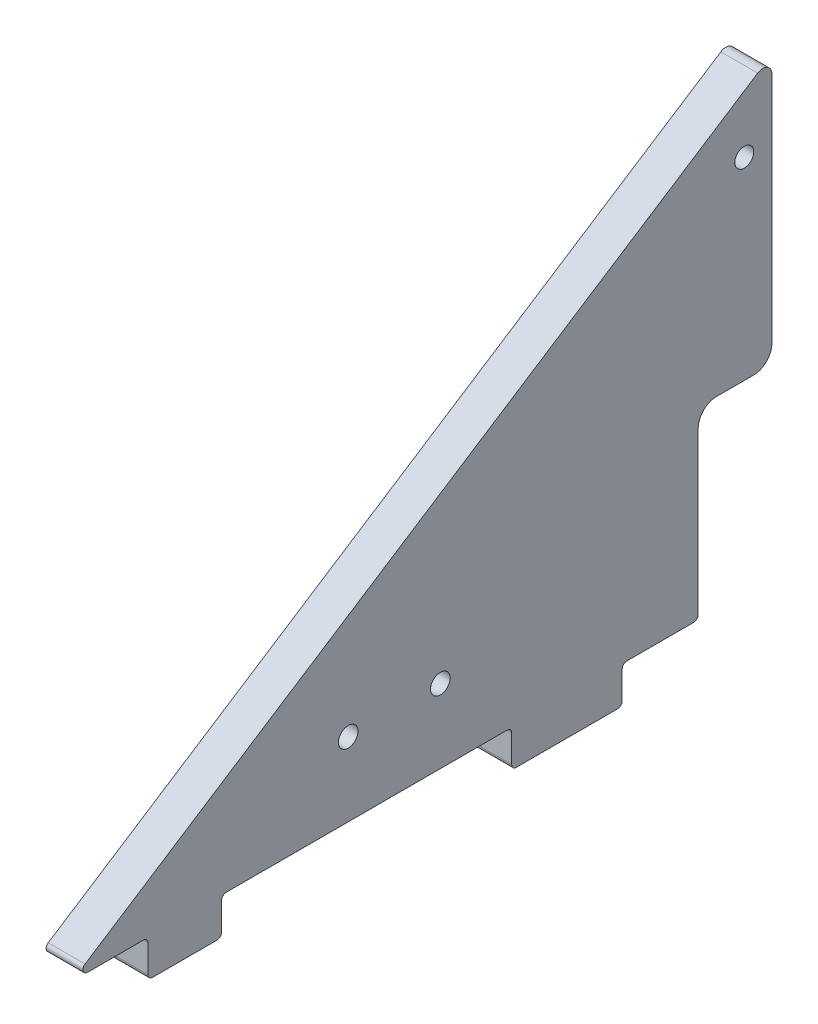
ISO-10303-21;
HEADER;
FILE_DESCRIPTION(('STEP AP214'),'2;1');
FILE_NAME('part.step','',(''),(''),'','','');
FILE_SCHEMA(('AUTOMOTIVE_DESIGN { 1 0 10303 214 1 1 1 1 }'));
ENDSEC;
DATA;
#1=APPLICATION_CONTEXT('core data for automotive mechanical design processes');
#2=APPLICATION_PROTOCOL_DEFINITION('international standard','automotive_design',2000,#1);
#3=PRODUCT_CONTEXT('',#1,'mechanical');
#4=PRODUCT('Part','Part','',(#3));
#5=PRODUCT_RELATED_PRODUCT_CATEGORY('part','',(#4));
#6=PRODUCT_DEFINITION_FORMATION('','',#4);
#7=PRODUCT_DEFINITION_CONTEXT('part definition',#1,'design');
#8=PRODUCT_DEFINITION('design','',#6,#7);
#9=PRODUCT_DEFINITION_SHAPE('','',#8);
#10=(LENGTH_UNIT() NAMED_UNIT(*) SI_UNIT(.MILLI.,.METRE.));
#11=(NAMED_UNIT(*) PLANE_ANGLE_UNIT() SI_UNIT($,.RADIAN.));
#12=(NAMED_UNIT(*) SI_UNIT($,.STERADIAN.) SOLID_ANGLE_UNIT());
#13=UNCERTAINTY_MEASURE_WITH_UNIT(LENGTH_MEASURE(1.E-05),#10,'distance_accuracy_value','');
#14=(GEOMETRIC_REPRESENTATION_CONTEXT(3) GLOBAL_UNCERTAINTY_ASSIGNED_CONTEXT((#13)) GLOBAL_UNIT_ASSIGNED_CONTEXT((#10,
#11,#12)) REPRESENTATION_CONTEXT('',''));
#15=CARTESIAN_POINT('',(0.,0.,0.));
#16=DIRECTION('',(0.,0.,1.));
#17=DIRECTION('',(1.,0.,0.));
#18=AXIS2_PLACEMENT_3D('',#15,#16,#17);
#19=CARTESIAN_POINT('',(6.35,0.,0.));
#20=DIRECTION('',(0.,0.,-1.));
#21=DIRECTION('',(0.,1.,0.));
#22=AXIS2_PLACEMENT_3D('',#19,#20,#21);
#23=PLANE('',#22);
#24=DIRECTION('',(0.,-1.,0.));
#25=VECTOR('',#24,1.);
#26=CARTESIAN_POINT('',(-6.35,0.,0.));
#27=LINE('',#26,#25);
#28=CARTESIAN_POINT('',(-6.35,57.15,0.));
#29=VERTEX_POINT('',#28);
#30=CARTESIAN_POINT('',(-6.35,1.5875,0.));
#31=VERTEX_POINT('',#30);
#32=EDGE_CURVE('E218',#29,#31,#27,.T.);
#33=ORIENTED_EDGE('',*,*,#32,.F.);
#34=DIRECTION('',(-1.,0.,0.));
#35=VECTOR('',#34,1.);
#36=CARTESIAN_POINT('',(6.35,57.15,0.));
#37=LINE('',#36,#35);
#38=CARTESIAN_POINT('',(6.35,57.15,0.));
#39=VERTEX_POINT('',#38);
#40=EDGE_CURVE('E49',#29,#39,#37,.F.);
#41=ORIENTED_EDGE('',*,*,#40,.T.);
#42=DIRECTION('',(0.,-1.,0.));
#43=VECTOR('',#42,1.);
#44=CARTESIAN_POINT('',(6.35,0.,0.));
#45=LINE('',#44,#43);
#46=CARTESIAN_POINT('',(6.35,1.5875,0.));
#47=VERTEX_POINT('',#46);
#48=EDGE_CURVE('E383',#39,#47,#45,.T.);
#49=ORIENTED_EDGE('',*,*,#48,.T.);
#50=DIRECTION('',(-1.,0.,0.));
#51=VECTOR('',#50,1.);
#52=CARTESIAN_POINT('',(6.35,1.5875,0.));
#53=LINE('',#52,#51);
#54=EDGE_CURVE('E317',#47,#31,#53,.T.);
#55=ORIENTED_EDGE('',*,*,#54,.T.);
#56=EDGE_LOOP('',(#33,#41,#49,#55));
#57=FACE_BOUND('',#56,.T.);
#58=ADVANCED_FACE('F34',(#57),#23,.T.);
#59=CARTESIAN_POINT('',(6.35,98.4714634146341,63.7168292682927));
#60=DIRECTION('',(0.,0.839570157152151,0.543251278157274));
#61=DIRECTION('',(0.,-0.543251278157274,0.839570157152151));
#62=AXIS2_PLACEMENT_3D('',#59,#60,#61);
#63=PLANE('',#62);
#64=DIRECTION('',(0.,0.543251278157274,-0.839570157152151));
#65=VECTOR('',#64,1.);
#66=CARTESIAN_POINT('',(-6.35,98.4714634146341,63.7168292682927));
#67=LINE('',#66,#65);
#68=CARTESIAN_POINT('',(-6.35,2.920317624479,211.386781853078));
#69=VERTEX_POINT('',#68);
#70=CARTESIAN_POINT('',(-6.35,152.964820535903,-20.5001771918507));
#71=VERTEX_POINT('',#70);
#72=EDGE_CURVE('E206',#69,#71,#67,.T.);
#73=ORIENTED_EDGE('',*,*,#72,.F.);
#74=DIRECTION('',(-1.,0.,0.));
#75=VECTOR('',#74,1.);
#76=CARTESIAN_POINT('',(6.35,2.92031762447902,211.386781853078));
#77=LINE('',#76,#75);
#78=CARTESIAN_POINT('',(6.35,2.920317624479,211.386781853078));
#79=VERTEX_POINT('',#78);
#80=EDGE_CURVE('E262',#69,#79,#77,.F.);
#81=ORIENTED_EDGE('',*,*,#80,.T.);
#82=DIRECTION('',(0.,0.543251278157274,-0.839570157152151));
#83=VECTOR('',#82,1.);
#84=CARTESIAN_POINT('',(6.35,98.4714634146341,63.7168292682927));
#85=LINE('',#84,#83);
#86=CARTESIAN_POINT('',(6.35,152.964820535903,-20.5001771918507));
#87=VERTEX_POINT('',#86);
#88=EDGE_CURVE('E230',#79,#87,#85,.T.);
#89=ORIENTED_EDGE('',*,*,#88,.T.);
#90=DIRECTION('',(-1.,0.,0.));
#91=VECTOR('',#90,1.);
#92=CARTESIAN_POINT('',(6.35,152.964820535903,-20.5001771918507));
#93=LINE('',#92,#91);
#94=EDGE_CURVE('E225',#87,#71,#93,.T.);
#95=ORIENTED_EDGE('',*,*,#94,.T.);
#96=EDGE_LOOP('',(#73,#81,#89,#95));
#97=FACE_BOUND('',#96,.T.);
#98=ADVANCED_FACE('F228',(#97),#63,.T.);
#99=CARTESIAN_POINT('',(6.35,0.,0.));
#100=DIRECTION('',(0.,-1.,0.));
#101=DIRECTION('',(0.,0.,-1.));
#102=AXIS2_PLACEMENT_3D('',#99,#100,#101);
#103=PLANE('',#102);
#104=DIRECTION('',(0.,0.,1.));
#105=VECTOR('',#104,1.);
#106=CARTESIAN_POINT('',(6.35,0.,0.));
#107=LINE('',#106,#105);
#108=CARTESIAN_POINT('',(6.35,0.,191.29375));
#109=VERTEX_POINT('',#108);
#110=CARTESIAN_POINT('',(6.35,0.,210.524370449003));
#111=VERTEX_POINT('',#110);
#112=EDGE_CURVE('E238',#109,#111,#107,.T.);
#113=ORIENTED_EDGE('',*,*,#112,.T.);
#114=DIRECTION('',(-1.,0.,0.));
#115=VECTOR('',#114,1.);
#116=CARTESIAN_POINT('',(6.35,0.,210.524370449003));
#117=LINE('',#116,#115);
#118=CARTESIAN_POINT('',(-6.35,0.,210.524370449003));
#119=VERTEX_POINT('',#118);
#120=EDGE_CURVE('E248',#111,#119,#117,.T.);
#121=ORIENTED_EDGE('',*,*,#120,.T.);
#122=DIRECTION('',(0.,0.,1.));
#123=VECTOR('',#122,1.);
#124=CARTESIAN_POINT('',(-6.35,0.,0.));
#125=LINE('',#124,#123);
#126=CARTESIAN_POINT('',(-6.35,0.,191.29375));
#127=VERTEX_POINT('',#126);
#128=EDGE_CURVE('E217',#127,#119,#125,.T.);
#129=ORIENTED_EDGE('',*,*,#128,.F.);
#130=DIRECTION('',(-1.,0.,0.));
#131=VECTOR('',#130,1.);
#132=CARTESIAN_POINT('',(6.35,0.,191.29375));
#133=LINE('',#132,#131);
#134=EDGE_CURVE('E246',#127,#109,#133,.F.);
#135=ORIENTED_EDGE('',*,*,#134,.T.);
#136=EDGE_LOOP('',(#113,#121,#129,#135));
#137=FACE_BOUND('',#136,.T.);
#138=ADVANCED_FACE('F430',(#137),#103,.T.);
#139=CARTESIAN_POINT('',(6.35,0.,189.70625));
#140=DIRECTION('',(0.,0.,-1.));
#141=DIRECTION('',(-1.,0.,0.));
#142=AXIS2_PLACEMENT_3D('',#139,#140,#141);
#143=PLANE('',#142);
#144=DIRECTION('',(0.,-1.,0.));
#145=VECTOR('',#144,1.);
#146=CARTESIAN_POINT('',(6.35,0.,189.70625));
#147=LINE('',#146,#145);
#148=CARTESIAN_POINT('',(6.35,-1.58750000000002,189.70625));
#149=VERTEX_POINT('',#148);
#150=CARTESIAN_POINT('',(6.35,-11.1125,189.70625));
#151=VERTEX_POINT('',#150);
#152=EDGE_CURVE('E387',#149,#151,#147,.T.);
#153=ORIENTED_EDGE('',*,*,#152,.F.);
#154=DIRECTION('',(-1.,0.,0.));
#155=VECTOR('',#154,1.);
#156=CARTESIAN_POINT('',(6.35,-1.58750000000002,189.70625));
#157=LINE('',#156,#155);
#158=CARTESIAN_POINT('',(-6.35,-1.58750000000002,189.70625));
#159=VERTEX_POINT('',#158);
#160=EDGE_CURVE('E304',#149,#159,#157,.T.);
#161=ORIENTED_EDGE('',*,*,#160,.T.);
#162=DIRECTION('',(0.,-1.,0.));
#163=VECTOR('',#162,1.);
#164=CARTESIAN_POINT('',(-6.35,0.,189.70625));
#165=LINE('',#164,#163);
#166=CARTESIAN_POINT('',(-6.35,-11.1125,189.70625));
#167=VERTEX_POINT('',#166);
#168=EDGE_CURVE('E409',#159,#167,#165,.T.);
#169=ORIENTED_EDGE('',*,*,#168,.T.);
#170=DIRECTION('',(-1.,0.,0.));
#171=VECTOR('',#170,1.);
#172=CARTESIAN_POINT('',(6.35,-11.1125,189.70625));
#173=LINE('',#172,#171);
#174=EDGE_CURVE('E302',#167,#151,#173,.F.);
#175=ORIENTED_EDGE('',*,*,#174,.T.);
#176=EDGE_LOOP('',(#153,#161,#169,#175));
#177=FACE_BOUND('',#176,.T.);
#178=ADVANCED_FACE('F441',(#177),#143,.F.);
#179=CARTESIAN_POINT('',(6.35,-12.7,0.));
#180=DIRECTION('',(0.,-1.,0.));
#181=DIRECTION('',(0.,0.,-1.));
#182=AXIS2_PLACEMENT_3D('',#179,#180,#181);
#183=PLANE('',#182);
#184=DIRECTION('',(0.,0.,1.));
#185=VECTOR('',#184,1.);
#186=CARTESIAN_POINT('',(-6.35,-12.7,0.));
#187=LINE('',#186,#185);
#188=CARTESIAN_POINT('',(-6.35,-12.7,165.89375));
#189=VERTEX_POINT('',#188);
#190=CARTESIAN_POINT('',(-6.35,-12.7,188.11875));
#191=VERTEX_POINT('',#190);
#192=EDGE_CURVE('E412',#189,#191,#187,.T.);
#193=ORIENTED_EDGE('',*,*,#192,.F.);
#194=DIRECTION('',(-1.,0.,0.));
#195=VECTOR('',#194,1.);
#196=CARTESIAN_POINT('',(6.35,-12.7,165.89375));
#197=LINE('',#196,#195);
#198=CARTESIAN_POINT('',(6.35,-12.7,165.89375));
#199=VERTEX_POINT('',#198);
#200=EDGE_CURVE('E310',#189,#199,#197,.F.);
#201=ORIENTED_EDGE('',*,*,#200,.T.);
#202=DIRECTION('',(0.,0.,1.));
#203=VECTOR('',#202,1.);
#204=CARTESIAN_POINT('',(6.35,-12.7,0.));
#205=LINE('',#204,#203);
#206=CARTESIAN_POINT('',(6.35,-12.7,188.11875));
#207=VERTEX_POINT('',#206);
#208=EDGE_CURVE('E390',#199,#207,#205,.T.);
#209=ORIENTED_EDGE('',*,*,#208,.T.);
#210=DIRECTION('',(-1.,0.,0.));
#211=VECTOR('',#210,1.);
#212=CARTESIAN_POINT('',(-6.35,-12.7,188.11875));
#213=LINE('',#212,#211);
#214=EDGE_CURVE('E307',#207,#191,#213,.T.);
#215=ORIENTED_EDGE('',*,*,#214,.T.);
#216=EDGE_LOOP('',(#193,#201,#209,#215));
#217=FACE_BOUND('',#216,.T.);
#218=ADVANCED_FACE('F450',(#217),#183,.T.);
#219=CARTESIAN_POINT('',(6.35,0.,164.30625));
#220=DIRECTION('',(0.,0.,-1.));
#221=DIRECTION('',(-1.,0.,0.));
#222=AXIS2_PLACEMENT_3D('',#219,#220,#221);
#223=PLANE('',#222);
#224=DIRECTION('',(0.,-1.,0.));
#225=VECTOR('',#224,1.);
#226=CARTESIAN_POINT('',(-6.35,0.,164.30625));
#227=LINE('',#226,#225);
#228=CARTESIAN_POINT('',(-6.35,-1.58750000000002,164.30625));
#229=VERTEX_POINT('',#228);
#230=CARTESIAN_POINT('',(-6.35,-11.1125,164.30625));
#231=VERTEX_POINT('',#230);
#232=EDGE_CURVE('E408',#229,#231,#227,.T.);
#233=ORIENTED_EDGE('',*,*,#232,.F.);
#234=DIRECTION('',(-1.,0.,0.));
#235=VECTOR('',#234,1.);
#236=CARTESIAN_POINT('',(6.35,-1.58750000000002,164.30625));
#237=LINE('',#236,#235);
#238=CARTESIAN_POINT('',(6.35,-1.58750000000002,164.30625));
#239=VERTEX_POINT('',#238);
#240=EDGE_CURVE('E300',#229,#239,#237,.F.);
#241=ORIENTED_EDGE('',*,*,#240,.T.);
#242=DIRECTION('',(0.,-1.,0.));
#243=VECTOR('',#242,1.);
#244=CARTESIAN_POINT('',(6.35,0.,164.30625));
#245=LINE('',#244,#243);
#246=CARTESIAN_POINT('',(6.35,-11.1125,164.30625));
#247=VERTEX_POINT('',#246);
#248=EDGE_CURVE('E393',#239,#247,#245,.T.);
#249=ORIENTED_EDGE('',*,*,#248,.T.);
#250=DIRECTION('',(-1.,0.,0.));
#251=VECTOR('',#250,1.);
#252=CARTESIAN_POINT('',(6.35,-11.1125,164.30625));
#253=LINE('',#252,#251);
#254=EDGE_CURVE('E297',#247,#231,#253,.T.);
#255=ORIENTED_EDGE('',*,*,#254,.T.);
#256=EDGE_LOOP('',(#233,#241,#249,#255));
#257=FACE_BOUND('',#256,.T.);
#258=ADVANCED_FACE('F459',(#257),#223,.T.);
#259=CARTESIAN_POINT('',(-6.35,0.,65.88125));
#260=VERTEX_POINT('',#259);
#261=CARTESIAN_POINT('',(-6.35,0.,162.71875));
#262=VERTEX_POINT('',#261);
#263=EDGE_CURVE('E404',#260,#262,#125,.T.);
#264=ORIENTED_EDGE('',*,*,#263,.F.);
#265=DIRECTION('',(-1.,0.,0.));
#266=VECTOR('',#265,1.);
#267=CARTESIAN_POINT('',(6.35,0.,65.88125));
#268=LINE('',#267,#266);
#269=CARTESIAN_POINT('',(6.35,0.,65.88125));
#270=VERTEX_POINT('',#269);
#271=EDGE_CURVE('E285',#260,#270,#268,.F.);
#272=ORIENTED_EDGE('',*,*,#271,.T.);
#273=CARTESIAN_POINT('',(6.35,0.,162.71875));
#274=VERTEX_POINT('',#273);
#275=EDGE_CURVE('E237',#270,#274,#107,.T.);
#276=ORIENTED_EDGE('',*,*,#275,.T.);
#277=DIRECTION('',(-1.,0.,0.));
#278=VECTOR('',#277,1.);
#279=CARTESIAN_POINT('',(-6.35,0.,162.71875));
#280=LINE('',#279,#278);
#281=EDGE_CURVE('E282',#274,#262,#280,.T.);
#282=ORIENTED_EDGE('',*,*,#281,.T.);
#283=EDGE_LOOP('',(#264,#272,#276,#282));
#284=FACE_BOUND('',#283,.T.);
#285=ADVANCED_FACE('F469',(#284),#103,.T.);
#286=CARTESIAN_POINT('',(6.35,0.,64.29375));
#287=DIRECTION('',(0.,0.,-1.));
#288=DIRECTION('',(-1.,0.,0.));
#289=AXIS2_PLACEMENT_3D('',#286,#287,#288);
#290=PLANE('',#289);
#291=DIRECTION('',(0.,-1.,0.));
#292=VECTOR('',#291,1.);
#293=CARTESIAN_POINT('',(6.35,0.,64.29375));
#294=LINE('',#293,#292);
#295=CARTESIAN_POINT('',(6.35,-1.58750000000001,64.29375));
#296=VERTEX_POINT('',#295);
#297=CARTESIAN_POINT('',(6.35,-11.1125,64.29375));
#298=VERTEX_POINT('',#297);
#299=EDGE_CURVE('E396',#296,#298,#294,.T.);
#300=ORIENTED_EDGE('',*,*,#299,.F.);
#301=DIRECTION('',(-1.,0.,0.));
#302=VECTOR('',#301,1.);
#303=CARTESIAN_POINT('',(6.35,-1.58750000000001,64.29375));
#304=LINE('',#303,#302);
#305=CARTESIAN_POINT('',(-6.35,-1.58750000000001,64.29375));
#306=VERTEX_POINT('',#305);
#307=EDGE_CURVE('E279',#296,#306,#304,.T.);
#308=ORIENTED_EDGE('',*,*,#307,.T.);
#309=DIRECTION('',(0.,-1.,0.));
#310=VECTOR('',#309,1.);
#311=CARTESIAN_POINT('',(-6.35,0.,64.29375));
#312=LINE('',#311,#310);
#313=CARTESIAN_POINT('',(-6.35,-11.1125,64.29375));
#314=VERTEX_POINT('',#313);
#315=EDGE_CURVE('E407',#306,#314,#312,.T.);
#316=ORIENTED_EDGE('',*,*,#315,.T.);
#317=DIRECTION('',(-1.,0.,0.));
#318=VECTOR('',#317,1.);
#319=CARTESIAN_POINT('',(6.35,-11.1125,64.29375));
#320=LINE('',#319,#318);
#321=EDGE_CURVE('E277',#314,#298,#320,.F.);
#322=ORIENTED_EDGE('',*,*,#321,.T.);
#323=EDGE_LOOP('',(#300,#308,#316,#322));
#324=FACE_BOUND('',#323,.T.);
#325=ADVANCED_FACE('F552',(#324),#290,.F.);
#326=CARTESIAN_POINT('',(6.35,-12.7,0.));
#327=DIRECTION('',(0.,-1.,0.));
#328=DIRECTION('',(0.,0.,-1.));
#329=AXIS2_PLACEMENT_3D('',#326,#327,#328);
#330=PLANE('',#329);
#331=DIRECTION('',(0.,0.,1.));
#332=VECTOR('',#331,1.);
#333=CARTESIAN_POINT('',(6.35,-12.7,0.));
#334=LINE('',#333,#332);
#335=CARTESIAN_POINT('',(6.35,-12.7,27.78125));
#336=VERTEX_POINT('',#335);
#337=CARTESIAN_POINT('',(6.35,-12.7,62.70625));
#338=VERTEX_POINT('',#337);
#339=EDGE_CURVE('E399',#336,#338,#334,.T.);
#340=ORIENTED_EDGE('',*,*,#339,.T.);
#341=DIRECTION('',(-1.,0.,0.));
#342=VECTOR('',#341,1.);
#343=CARTESIAN_POINT('',(-6.35,-12.7,62.70625));
#344=LINE('',#343,#342);
#345=CARTESIAN_POINT('',(-6.35,-12.7,62.70625));
#346=VERTEX_POINT('',#345);
#347=EDGE_CURVE('E314',#338,#346,#344,.T.);
#348=ORIENTED_EDGE('',*,*,#347,.T.);
#349=DIRECTION('',(0.,0.,1.));
#350=VECTOR('',#349,1.);
#351=CARTESIAN_POINT('',(-6.35,-12.7,0.));
#352=LINE('',#351,#350);
#353=CARTESIAN_POINT('',(-6.35,-12.7,27.78125));
#354=VERTEX_POINT('',#353);
#355=EDGE_CURVE('E418',#354,#346,#352,.T.);
#356=ORIENTED_EDGE('',*,*,#355,.F.);
#357=DIRECTION('',(-1.,0.,0.));
#358=VECTOR('',#357,1.);
#359=CARTESIAN_POINT('',(6.35,-12.7,27.78125));
#360=LINE('',#359,#358);
#361=EDGE_CURVE('E312',#354,#336,#360,.F.);
#362=ORIENTED_EDGE('',*,*,#361,.T.);
#363=EDGE_LOOP('',(#340,#348,#356,#362));
#364=FACE_BOUND('',#363,.T.);
#365=ADVANCED_FACE('F544',(#364),#330,.T.);
#366=CARTESIAN_POINT('',(6.35,0.,26.19375));
#367=DIRECTION('',(0.,0.,-1.));
#368=DIRECTION('',(-1.,0.,0.));
#369=AXIS2_PLACEMENT_3D('',#366,#367,#368);
#370=PLANE('',#369);
#371=DIRECTION('',(0.,-1.,0.));
#372=VECTOR('',#371,1.);
#373=CARTESIAN_POINT('',(-6.35,0.,26.19375));
#374=LINE('',#373,#372);
#375=CARTESIAN_POINT('',(-6.35,-1.5875,26.19375));
#376=VERTEX_POINT('',#375);
#377=CARTESIAN_POINT('',(-6.35,-11.1125,26.19375));
#378=VERTEX_POINT('',#377);
#379=EDGE_CURVE('E240',#376,#378,#374,.T.);
#380=ORIENTED_EDGE('',*,*,#379,.F.);
#381=DIRECTION('',(-1.,0.,0.));
#382=VECTOR('',#381,1.);
#383=CARTESIAN_POINT('',(6.35,-1.5875,26.19375));
#384=LINE('',#383,#382);
#385=CARTESIAN_POINT('',(6.35,-1.5875,26.19375));
#386=VERTEX_POINT('',#385);
#387=EDGE_CURVE('E295',#376,#386,#384,.F.);
#388=ORIENTED_EDGE('',*,*,#387,.T.);
#389=DIRECTION('',(0.,-1.,0.));
#390=VECTOR('',#389,1.);
#391=CARTESIAN_POINT('',(6.35,0.,26.19375));
#392=LINE('',#391,#390);
#393=CARTESIAN_POINT('',(6.35,-11.1125,26.19375));
#394=VERTEX_POINT('',#393);
#395=EDGE_CURVE('E235',#386,#394,#392,.T.);
#396=ORIENTED_EDGE('',*,*,#395,.T.);
#397=DIRECTION('',(-1.,0.,0.));
#398=VECTOR('',#397,1.);
#399=CARTESIAN_POINT('',(6.35,-11.1125,26.19375));
#400=LINE('',#399,#398);
#401=EDGE_CURVE('E292',#394,#378,#400,.T.);
#402=ORIENTED_EDGE('',*,*,#401,.T.);
#403=EDGE_LOOP('',(#380,#388,#396,#402));
#404=FACE_BOUND('',#403,.T.);
#405=ADVANCED_FACE('F539',(#404),#370,.T.);
#406=CARTESIAN_POINT('',(6.35,0.,1.5875));
#407=VERTEX_POINT('',#406);
#408=CARTESIAN_POINT('',(6.35,0.,24.60625));
#409=VERTEX_POINT('',#408);
#410=EDGE_CURVE('E232',#407,#409,#107,.T.);
#411=ORIENTED_EDGE('',*,*,#410,.T.);
#412=DIRECTION('',(-1.,0.,0.));
#413=VECTOR('',#412,1.);
#414=CARTESIAN_POINT('',(-6.35,0.,24.60625));
#415=LINE('',#414,#413);
#416=CARTESIAN_POINT('',(-6.35,0.,24.60625));
#417=VERTEX_POINT('',#416);
#418=EDGE_CURVE('E289',#409,#417,#415,.T.);
#419=ORIENTED_EDGE('',*,*,#418,.T.);
#420=CARTESIAN_POINT('',(-6.35,0.,1.5875));
#421=VERTEX_POINT('',#420);
#422=EDGE_CURVE('E385',#421,#417,#125,.T.);
#423=ORIENTED_EDGE('',*,*,#422,.F.);
#424=DIRECTION('',(-1.,0.,0.));
#425=VECTOR('',#424,1.);
#426=CARTESIAN_POINT('',(6.35,0.,1.5875));
#427=LINE('',#426,#425);
#428=EDGE_CURVE('E287',#421,#407,#427,.F.);
#429=ORIENTED_EDGE('',*,*,#428,.T.);
#430=EDGE_LOOP('',(#411,#419,#423,#429));
#431=FACE_BOUND('',#430,.T.);
#432=ADVANCED_FACE('F536',(#431),#103,.T.);
#433=CARTESIAN_POINT('',(6.35,0.,0.));
#434=DIRECTION('',(1.,0.,0.));
#435=DIRECTION('',(0.,0.,-1.));
#436=AXIS2_PLACEMENT_3D('',#433,#434,#435);
#437=PLANE('',#436);
#438=CARTESIAN_POINT('',(6.35,130.175,-15.875));
#439=DIRECTION('',(1.,0.,0.));
#440=DIRECTION('',(0.,0.,-1.));
#441=AXIS2_PLACEMENT_3D('',#438,#439,#440);
#442=CIRCLE('',#441,3.26389999999999);
#443=CARTESIAN_POINT('',(6.35,130.175,-19.1389));
#444=VERTEX_POINT('',#443);
#445=EDGE_CURVE('E814',#444,#444,#442,.T.);
#446=ORIENTED_EDGE('',*,*,#445,.F.);
#447=EDGE_LOOP('',(#446));
#448=FACE_BOUND('',#447,.T.);
#449=CARTESIAN_POINT('',(6.35,25.4,88.9));
#450=DIRECTION('',(1.,0.,0.));
#451=DIRECTION('',(0.,0.,-1.));
#452=AXIS2_PLACEMENT_3D('',#449,#450,#451);
#453=CIRCLE('',#452,3.3782);
#454=CARTESIAN_POINT('',(6.35,25.4,85.5218));
#455=VERTEX_POINT('',#454);
#456=EDGE_CURVE('E362',#455,#455,#453,.T.);
#457=ORIENTED_EDGE('',*,*,#456,.F.);
#458=EDGE_LOOP('',(#457));
#459=FACE_BOUND('',#458,.T.);
#460=CARTESIAN_POINT('',(6.35,25.4,120.65));
#461=DIRECTION('',(1.,0.,0.));
#462=DIRECTION('',(0.,0.,-1.));
#463=AXIS2_PLACEMENT_3D('',#460,#461,#462);
#464=CIRCLE('',#463,3.3782);
#465=CARTESIAN_POINT('',(6.35,25.4,117.2718));
#466=VERTEX_POINT('',#465);
#467=EDGE_CURVE('E378',#466,#466,#464,.T.);
#468=ORIENTED_EDGE('',*,*,#467,.F.);
#469=EDGE_LOOP('',(#468));
#470=FACE_BOUND('',#469,.T.);
#471=DIRECTION('',(0.,0.,1.));
#472=VECTOR('',#471,1.);
#473=CARTESIAN_POINT('',(6.35,63.5,-25.4));
#474=LINE('',#473,#472);
#475=CARTESIAN_POINT('',(6.35,63.5,-19.05));
#476=VERTEX_POINT('',#475);
#477=CARTESIAN_POINT('',(6.35,63.5,-6.35000000000001));
#478=VERTEX_POINT('',#477);
#479=EDGE_CURVE('E360',#476,#478,#474,.T.);
#480=ORIENTED_EDGE('',*,*,#479,.F.);
#481=CARTESIAN_POINT('',(6.35,69.85,-19.05));
#482=DIRECTION('',(1.,0.,0.));
#483=DIRECTION('',(0.,0.,-1.));
#484=AXIS2_PLACEMENT_3D('',#481,#482,#483);
#485=CIRCLE('',#484,6.35);
#486=CARTESIAN_POINT('',(6.35,69.85,-25.4));
#487=VERTEX_POINT('',#486);
#488=EDGE_CURVE('E346',#476,#487,#485,.T.);
#489=ORIENTED_EDGE('',*,*,#488,.T.);
#490=DIRECTION('',(0.,-1.,0.));
#491=VECTOR('',#490,1.);
#492=CARTESIAN_POINT('',(6.35,156.135294117647,-25.4));
#493=LINE('',#492,#491);
#494=CARTESIAN_POINT('',(6.35,150.299185286945,-25.4));
#495=VERTEX_POINT('',#494);
#496=EDGE_CURVE('E363',#495,#487,#493,.T.);
#497=ORIENTED_EDGE('',*,*,#496,.F.);
#498=CARTESIAN_POINT('',(6.35,150.299185286945,-22.2250000000001));
#499=DIRECTION('',(1.,0.,0.));
#500=DIRECTION('',(0.,0.,-1.));
#501=AXIS2_PLACEMENT_3D('',#498,#499,#500);
#502=CIRCLE('',#501,3.175);
#503=EDGE_CURVE('E244',#495,#87,#502,.T.);
#504=ORIENTED_EDGE('',*,*,#503,.T.);
#505=ORIENTED_EDGE('',*,*,#88,.F.);
#506=CARTESIAN_POINT('',(6.35,1.58749999999997,210.524370449003));
#507=DIRECTION('',(1.,0.,0.));
#508=DIRECTION('',(0.,0.,-1.));
#509=AXIS2_PLACEMENT_3D('',#506,#507,#508);
#510=CIRCLE('',#509,1.5875);
#511=EDGE_CURVE('E275',#79,#111,#510,.T.);
#512=ORIENTED_EDGE('',*,*,#511,.T.);
#513=ORIENTED_EDGE('',*,*,#112,.F.);
#514=CARTESIAN_POINT('',(6.35,-1.58750000000002,191.29375));
#515=DIRECTION('',(1.,0.,0.));
#516=DIRECTION('',(0.,0.,-1.));
#517=AXIS2_PLACEMENT_3D('',#514,#515,#516);
#518=CIRCLE('',#517,1.5875);
#519=EDGE_CURVE('E334',#109,#149,#518,.F.);
#520=ORIENTED_EDGE('',*,*,#519,.T.);
#521=ORIENTED_EDGE('',*,*,#152,.T.);
#522=CARTESIAN_POINT('',(6.35,-11.1125,188.11875));
#523=DIRECTION('',(1.,0.,0.));
#524=DIRECTION('',(0.,0.,-1.));
#525=AXIS2_PLACEMENT_3D('',#522,#523,#524);
#526=CIRCLE('',#525,1.5875);
#527=EDGE_CURVE('E271',#151,#207,#526,.T.);
#528=ORIENTED_EDGE('',*,*,#527,.T.);
#529=ORIENTED_EDGE('',*,*,#208,.F.);
#530=CARTESIAN_POINT('',(6.35,-11.1125,165.89375));
#531=DIRECTION('',(1.,0.,0.));
#532=DIRECTION('',(0.,0.,-1.));
#533=AXIS2_PLACEMENT_3D('',#530,#531,#532);
#534=CIRCLE('',#533,1.5875);
#535=EDGE_CURVE('E273',#199,#247,#534,.T.);
#536=ORIENTED_EDGE('',*,*,#535,.T.);
#537=ORIENTED_EDGE('',*,*,#248,.F.);
#538=CARTESIAN_POINT('',(6.35,-1.58750000000002,162.71875));
#539=DIRECTION('',(1.,0.,0.));
#540=DIRECTION('',(0.,0.,-1.));
#541=AXIS2_PLACEMENT_3D('',#538,#539,#540);
#542=CIRCLE('',#541,1.5875);
#543=EDGE_CURVE('E330',#239,#274,#542,.F.);
#544=ORIENTED_EDGE('',*,*,#543,.T.);
#545=ORIENTED_EDGE('',*,*,#275,.F.);
#546=CARTESIAN_POINT('',(6.35,-1.58750000000001,65.88125));
#547=DIRECTION('',(1.,0.,0.));
#548=DIRECTION('',(0.,0.,-1.));
#549=AXIS2_PLACEMENT_3D('',#546,#547,#548);
#550=CIRCLE('',#549,1.5875);
#551=EDGE_CURVE('E322',#270,#296,#550,.F.);
#552=ORIENTED_EDGE('',*,*,#551,.T.);
#553=ORIENTED_EDGE('',*,*,#299,.T.);
#554=CARTESIAN_POINT('',(6.35,-11.1125,62.70625));
#555=DIRECTION('',(1.,0.,0.));
#556=DIRECTION('',(0.,0.,-1.));
#557=AXIS2_PLACEMENT_3D('',#554,#555,#556);
#558=CIRCLE('',#557,1.5875);
#559=EDGE_CURVE('E269',#298,#338,#558,.T.);
#560=ORIENTED_EDGE('',*,*,#559,.T.);
#561=ORIENTED_EDGE('',*,*,#339,.F.);
#562=CARTESIAN_POINT('',(6.35,-11.1125,27.78125));
#563=DIRECTION('',(1.,0.,0.));
#564=DIRECTION('',(0.,0.,-1.));
#565=AXIS2_PLACEMENT_3D('',#562,#563,#564);
#566=CIRCLE('',#565,1.5875);
#567=EDGE_CURVE('E267',#336,#394,#566,.T.);
#568=ORIENTED_EDGE('',*,*,#567,.T.);
#569=ORIENTED_EDGE('',*,*,#395,.F.);
#570=CARTESIAN_POINT('',(6.35,-1.5875,24.60625));
#571=DIRECTION('',(1.,0.,0.));
#572=DIRECTION('',(0.,0.,-1.));
#573=AXIS2_PLACEMENT_3D('',#570,#571,#572);
#574=CIRCLE('',#573,1.5875);
#575=EDGE_CURVE('E326',#386,#409,#574,.F.);
#576=ORIENTED_EDGE('',*,*,#575,.T.);
#577=ORIENTED_EDGE('',*,*,#410,.F.);
#578=CARTESIAN_POINT('',(6.35,1.5875,1.5875));
#579=DIRECTION('',(1.,0.,0.));
#580=DIRECTION('',(0.,0.,-1.));
#581=AXIS2_PLACEMENT_3D('',#578,#579,#580);
#582=CIRCLE('',#581,1.5875);
#583=EDGE_CURVE('E264',#407,#47,#582,.T.);
#584=ORIENTED_EDGE('',*,*,#583,.T.);
#585=ORIENTED_EDGE('',*,*,#48,.F.);
#586=CARTESIAN_POINT('',(6.35,57.15,-6.35));
#587=DIRECTION('',(1.,0.,0.));
#588=DIRECTION('',(0.,0.,-1.));
#589=AXIS2_PLACEMENT_3D('',#586,#587,#588);
#590=CIRCLE('',#589,6.35);
#591=EDGE_CURVE('E11',#39,#478,#590,.F.);
#592=ORIENTED_EDGE('',*,*,#591,.T.);
#593=EDGE_LOOP('',(#480,#489,#497,#504,#505,#512,#513,#520,#521,#528,#529,#536,#537,#544,#545,
#552,#553,#560,#561,#568,#569,#576,#577,#584,#585,#592));
#594=FACE_BOUND('',#593,.T.);
#595=ADVANCED_FACE('F438',(#448,#459,#470,#594),#437,.T.);
#596=CARTESIAN_POINT('',(-6.35,0.,0.));
#597=DIRECTION('',(1.,0.,0.));
#598=DIRECTION('',(0.,0.,-1.));
#599=AXIS2_PLACEMENT_3D('',#596,#597,#598);
#600=PLANE('',#599);
#601=CARTESIAN_POINT('',(-6.35,130.175,-15.875));
#602=DIRECTION('',(1.,0.,0.));
#603=DIRECTION('',(0.,0.,-1.));
#604=AXIS2_PLACEMENT_3D('',#601,#602,#603);
#605=CIRCLE('',#604,3.26389999999999);
#606=CARTESIAN_POINT('',(-6.35,130.175,-19.1389));
#607=VERTEX_POINT('',#606);
#608=EDGE_CURVE('E374',#607,#607,#605,.T.);
#609=ORIENTED_EDGE('',*,*,#608,.T.);
#610=EDGE_LOOP('',(#609));
#611=FACE_BOUND('',#610,.T.);
#612=CARTESIAN_POINT('',(-6.35,25.4,88.9));
#613=DIRECTION('',(1.,0.,0.));
#614=DIRECTION('',(0.,0.,-1.));
#615=AXIS2_PLACEMENT_3D('',#612,#613,#614);
#616=CIRCLE('',#615,3.3782);
#617=CARTESIAN_POINT('',(-6.35,25.4,85.5218));
#618=VERTEX_POINT('',#617);
#619=EDGE_CURVE('E366',#618,#618,#616,.T.);
#620=ORIENTED_EDGE('',*,*,#619,.T.);
#621=EDGE_LOOP('',(#620));
#622=FACE_BOUND('',#621,.T.);
#623=CARTESIAN_POINT('',(-6.35,25.4,120.65));
#624=DIRECTION('',(1.,0.,0.));
#625=DIRECTION('',(0.,0.,-1.));
#626=AXIS2_PLACEMENT_3D('',#623,#624,#625);
#627=CIRCLE('',#626,3.3782);
#628=CARTESIAN_POINT('',(-6.35,25.4,117.2718));
#629=VERTEX_POINT('',#628);
#630=EDGE_CURVE('E355',#629,#629,#627,.T.);
#631=ORIENTED_EDGE('',*,*,#630,.T.);
#632=EDGE_LOOP('',(#631));
#633=FACE_BOUND('',#632,.T.);
#634=DIRECTION('',(0.,-1.,0.));
#635=VECTOR('',#634,1.);
#636=CARTESIAN_POINT('',(-6.35,156.135294117647,-25.4));
#637=LINE('',#636,#635);
#638=CARTESIAN_POINT('',(-6.35,150.299185286945,-25.4));
#639=VERTEX_POINT('',#638);
#640=CARTESIAN_POINT('',(-6.35,69.85,-25.4));
#641=VERTEX_POINT('',#640);
#642=EDGE_CURVE('E372',#639,#641,#637,.T.);
#643=ORIENTED_EDGE('',*,*,#642,.T.);
#644=CARTESIAN_POINT('',(-6.35,69.85,-19.05));
#645=DIRECTION('',(1.,0.,0.));
#646=DIRECTION('',(0.,0.,-1.));
#647=AXIS2_PLACEMENT_3D('',#644,#645,#646);
#648=CIRCLE('',#647,6.35);
#649=CARTESIAN_POINT('',(-6.35,63.5,-19.05));
#650=VERTEX_POINT('',#649);
#651=EDGE_CURVE('E339',#641,#650,#648,.F.);
#652=ORIENTED_EDGE('',*,*,#651,.T.);
#653=DIRECTION('',(0.,0.,1.));
#654=VECTOR('',#653,1.);
#655=CARTESIAN_POINT('',(-6.35,63.5,-25.4));
#656=LINE('',#655,#654);
#657=CARTESIAN_POINT('',(-6.35,63.5,-6.35000000000001));
#658=VERTEX_POINT('',#657);
#659=EDGE_CURVE('E351',#650,#658,#656,.T.);
#660=ORIENTED_EDGE('',*,*,#659,.T.);
#661=CARTESIAN_POINT('',(-6.35,57.15,-6.35));
#662=DIRECTION('',(1.,0.,0.));
#663=DIRECTION('',(0.,0.,-1.));
#664=AXIS2_PLACEMENT_3D('',#661,#662,#663);
#665=CIRCLE('',#664,6.35);
#666=EDGE_CURVE('E42',#658,#29,#665,.T.);
#667=ORIENTED_EDGE('',*,*,#666,.T.);
#668=ORIENTED_EDGE('',*,*,#32,.T.);
#669=CARTESIAN_POINT('',(-6.35,1.5875,1.5875));
#670=DIRECTION('',(1.,0.,0.));
#671=DIRECTION('',(0.,0.,-1.));
#672=AXIS2_PLACEMENT_3D('',#669,#670,#671);
#673=CIRCLE('',#672,1.5875);
#674=EDGE_CURVE('E251',#31,#421,#673,.F.);
#675=ORIENTED_EDGE('',*,*,#674,.T.);
#676=ORIENTED_EDGE('',*,*,#422,.T.);
#677=CARTESIAN_POINT('',(-6.35,-1.5875,24.60625));
#678=DIRECTION('',(1.,0.,0.));
#679=DIRECTION('',(0.,0.,-1.));
#680=AXIS2_PLACEMENT_3D('',#677,#678,#679);
#681=CIRCLE('',#680,1.5875);
#682=EDGE_CURVE('E324',#417,#376,#681,.T.);
#683=ORIENTED_EDGE('',*,*,#682,.T.);
#684=ORIENTED_EDGE('',*,*,#379,.T.);
#685=CARTESIAN_POINT('',(-6.35,-11.1125,27.78125));
#686=DIRECTION('',(1.,0.,0.));
#687=DIRECTION('',(0.,0.,-1.));
#688=AXIS2_PLACEMENT_3D('',#685,#686,#687);
#689=CIRCLE('',#688,1.5875);
#690=EDGE_CURVE('E253',#378,#354,#689,.F.);
#691=ORIENTED_EDGE('',*,*,#690,.T.);
#692=ORIENTED_EDGE('',*,*,#355,.T.);
#693=CARTESIAN_POINT('',(-6.35,-11.1125,62.70625));
#694=DIRECTION('',(1.,0.,0.));
#695=DIRECTION('',(0.,0.,-1.));
#696=AXIS2_PLACEMENT_3D('',#693,#694,#695);
#697=CIRCLE('',#696,1.5875);
#698=EDGE_CURVE('E255',#346,#314,#697,.F.);
#699=ORIENTED_EDGE('',*,*,#698,.T.);
#700=ORIENTED_EDGE('',*,*,#315,.F.);
#701=CARTESIAN_POINT('',(-6.35,-1.58750000000001,65.88125));
#702=DIRECTION('',(1.,0.,0.));
#703=DIRECTION('',(0.,0.,-1.));
#704=AXIS2_PLACEMENT_3D('',#701,#702,#703);
#705=CIRCLE('',#704,1.5875);
#706=EDGE_CURVE('E320',#306,#260,#705,.T.);
#707=ORIENTED_EDGE('',*,*,#706,.T.);
#708=ORIENTED_EDGE('',*,*,#263,.T.);
#709=CARTESIAN_POINT('',(-6.35,-1.58750000000002,162.71875));
#710=DIRECTION('',(1.,0.,0.));
#711=DIRECTION('',(0.,0.,-1.));
#712=AXIS2_PLACEMENT_3D('',#709,#710,#711);
#713=CIRCLE('',#712,1.5875);
#714=EDGE_CURVE('E328',#262,#229,#713,.T.);
#715=ORIENTED_EDGE('',*,*,#714,.T.);
#716=ORIENTED_EDGE('',*,*,#232,.T.);
#717=CARTESIAN_POINT('',(-6.35,-11.1125,165.89375));
#718=DIRECTION('',(1.,0.,0.));
#719=DIRECTION('',(0.,0.,-1.));
#720=AXIS2_PLACEMENT_3D('',#717,#718,#719);
#721=CIRCLE('',#720,1.5875);
#722=EDGE_CURVE('E259',#231,#189,#721,.F.);
#723=ORIENTED_EDGE('',*,*,#722,.T.);
#724=ORIENTED_EDGE('',*,*,#192,.T.);
#725=CARTESIAN_POINT('',(-6.35,-11.1125,188.11875));
#726=DIRECTION('',(1.,0.,0.));
#727=DIRECTION('',(0.,0.,-1.));
#728=AXIS2_PLACEMENT_3D('',#725,#726,#727);
#729=CIRCLE('',#728,1.5875);
#730=EDGE_CURVE('E257',#191,#167,#729,.F.);
#731=ORIENTED_EDGE('',*,*,#730,.T.);
#732=ORIENTED_EDGE('',*,*,#168,.F.);
#733=CARTESIAN_POINT('',(-6.35,-1.58750000000002,191.29375));
#734=DIRECTION('',(1.,0.,0.));
#735=DIRECTION('',(0.,0.,-1.));
#736=AXIS2_PLACEMENT_3D('',#733,#734,#735);
#737=CIRCLE('',#736,1.5875);
#738=EDGE_CURVE('E332',#159,#127,#737,.T.);
#739=ORIENTED_EDGE('',*,*,#738,.T.);
#740=ORIENTED_EDGE('',*,*,#128,.T.);
#741=CARTESIAN_POINT('',(-6.35,1.58749999999997,210.524370449003));
#742=DIRECTION('',(1.,0.,0.));
#743=DIRECTION('',(0.,0.,-1.));
#744=AXIS2_PLACEMENT_3D('',#741,#742,#743);
#745=CIRCLE('',#744,1.5875);
#746=EDGE_CURVE('E213',#119,#69,#745,.F.);
#747=ORIENTED_EDGE('',*,*,#746,.T.);
#748=ORIENTED_EDGE('',*,*,#72,.T.);
#749=CARTESIAN_POINT('',(-6.35,150.299185286945,-22.2250000000001));
#750=DIRECTION('',(1.,0.,0.));
#751=DIRECTION('',(0.,0.,-1.));
#752=AXIS2_PLACEMENT_3D('',#749,#750,#751);
#753=CIRCLE('',#752,3.175);
#754=EDGE_CURVE('E210',#71,#639,#753,.F.);
#755=ORIENTED_EDGE('',*,*,#754,.T.);
#756=EDGE_LOOP('',(#643,#652,#660,#667,#668,#675,#676,#683,#684,#691,#692,#699,#700,#707,#708,
#715,#716,#723,#724,#731,#732,#739,#740,#747,#748,#755));
#757=FACE_BOUND('',#756,.T.);
#758=ADVANCED_FACE('F209',(#611,#622,#633,#757),#600,.F.);
#759=CARTESIAN_POINT('',(6.35,25.4,120.65));
#760=DIRECTION('',(1.,0.,0.));
#761=DIRECTION('',(0.,0.,-1.));
#762=AXIS2_PLACEMENT_3D('',#759,#760,#761);
#763=CYLINDRICAL_SURFACE('',#762,3.3782);
#764=ORIENTED_EDGE('',*,*,#630,.F.);
#765=EDGE_LOOP('',(#764));
#766=FACE_BOUND('',#765,.T.);
#767=ORIENTED_EDGE('',*,*,#467,.T.);
#768=EDGE_LOOP('',(#767));
#769=FACE_BOUND('',#768,.T.);
#770=ADVANCED_FACE('F647',(#766,#769),#763,.F.);
#771=CARTESIAN_POINT('',(6.35,25.4,88.9));
#772=DIRECTION('',(1.,0.,0.));
#773=DIRECTION('',(0.,0.,-1.));
#774=AXIS2_PLACEMENT_3D('',#771,#772,#773);
#775=CYLINDRICAL_SURFACE('',#774,3.3782);
#776=ORIENTED_EDGE('',*,*,#619,.F.);
#777=EDGE_LOOP('',(#776));
#778=FACE_BOUND('',#777,.T.);
#779=ORIENTED_EDGE('',*,*,#456,.T.);
#780=EDGE_LOOP('',(#779));
#781=FACE_BOUND('',#780,.T.);
#782=ADVANCED_FACE('F643',(#778,#781),#775,.F.);
#783=CARTESIAN_POINT('',(6.35,156.135294117647,-25.4));
#784=DIRECTION('',(0.,0.,-1.));
#785=DIRECTION('',(0.,1.,0.));
#786=AXIS2_PLACEMENT_3D('',#783,#784,#785);
#787=PLANE('',#786);
#788=ORIENTED_EDGE('',*,*,#496,.T.);
#789=DIRECTION('',(-1.,0.,0.));
#790=VECTOR('',#789,1.);
#791=CARTESIAN_POINT('',(6.35,69.85,-25.4));
#792=LINE('',#791,#790);
#793=EDGE_CURVE('E336',#487,#641,#792,.T.);
#794=ORIENTED_EDGE('',*,*,#793,.T.);
#795=ORIENTED_EDGE('',*,*,#642,.F.);
#796=DIRECTION('',(-1.,0.,0.));
#797=VECTOR('',#796,1.);
#798=CARTESIAN_POINT('',(6.35,150.299185286945,-25.4));
#799=LINE('',#798,#797);
#800=EDGE_CURVE('E226',#639,#495,#799,.F.);
#801=ORIENTED_EDGE('',*,*,#800,.T.);
#802=EDGE_LOOP('',(#788,#794,#795,#801));
#803=FACE_BOUND('',#802,.T.);
#804=ADVANCED_FACE('F477',(#803),#787,.T.);
#805=CARTESIAN_POINT('',(6.35,63.5,-25.4));
#806=DIRECTION('',(0.,-1.,0.));
#807=DIRECTION('',(0.,0.,-1.));
#808=AXIS2_PLACEMENT_3D('',#805,#806,#807);
#809=PLANE('',#808);
#810=ORIENTED_EDGE('',*,*,#659,.F.);
#811=DIRECTION('',(-1.,0.,0.));
#812=VECTOR('',#811,1.);
#813=CARTESIAN_POINT('',(6.35,63.5,-19.05));
#814=LINE('',#813,#812);
#815=EDGE_CURVE('E344',#650,#476,#814,.F.);
#816=ORIENTED_EDGE('',*,*,#815,.T.);
#817=ORIENTED_EDGE('',*,*,#479,.T.);
#818=DIRECTION('',(-1.,0.,0.));
#819=VECTOR('',#818,1.);
#820=CARTESIAN_POINT('',(-6.35,63.5,-6.35));
#821=LINE('',#820,#819);
#822=EDGE_CURVE('E341',#478,#658,#821,.T.);
#823=ORIENTED_EDGE('',*,*,#822,.T.);
#824=EDGE_LOOP('',(#810,#816,#817,#823));
#825=FACE_BOUND('',#824,.T.);
#826=ADVANCED_FACE('F358',(#825),#809,.T.);
#827=CARTESIAN_POINT('',(6.35,150.299185286945,-22.2250000000001));
#828=DIRECTION('',(-1.,0.,0.));
#829=DIRECTION('',(0.,0.,1.));
#830=AXIS2_PLACEMENT_3D('',#827,#828,#829);
#831=CYLINDRICAL_SURFACE('',#830,3.175);
#832=ORIENTED_EDGE('',*,*,#503,.F.);
#833=ORIENTED_EDGE('',*,*,#800,.F.);
#834=ORIENTED_EDGE('',*,*,#754,.F.);
#835=ORIENTED_EDGE('',*,*,#94,.F.);
#836=EDGE_LOOP('',(#832,#833,#834,#835));
#837=FACE_BOUND('',#836,.T.);
#838=ADVANCED_FACE('F224',(#837),#831,.T.);
#839=CARTESIAN_POINT('',(6.35,1.58749999999997,210.524370449003));
#840=DIRECTION('',(-1.,0.,0.));
#841=DIRECTION('',(0.,0.,1.));
#842=AXIS2_PLACEMENT_3D('',#839,#840,#841);
#843=CYLINDRICAL_SURFACE('',#842,1.5875);
#844=ORIENTED_EDGE('',*,*,#511,.F.);
#845=ORIENTED_EDGE('',*,*,#80,.F.);
#846=ORIENTED_EDGE('',*,*,#746,.F.);
#847=ORIENTED_EDGE('',*,*,#120,.F.);
#848=EDGE_LOOP('',(#844,#845,#846,#847));
#849=FACE_BOUND('',#848,.T.);
#850=ADVANCED_FACE('F473',(#849),#843,.T.);
#851=CARTESIAN_POINT('',(6.35,-1.58750000000001,65.88125));
#852=DIRECTION('',(-1.,0.,0.));
#853=DIRECTION('',(0.,0.,1.));
#854=AXIS2_PLACEMENT_3D('',#851,#852,#853);
#855=CYLINDRICAL_SURFACE('',#854,1.5875);
#856=ORIENTED_EDGE('',*,*,#551,.F.);
#857=ORIENTED_EDGE('',*,*,#271,.F.);
#858=ORIENTED_EDGE('',*,*,#706,.F.);
#859=ORIENTED_EDGE('',*,*,#307,.F.);
#860=EDGE_LOOP('',(#856,#857,#858,#859));
#861=FACE_BOUND('',#860,.T.);
#862=ADVANCED_FACE('F502',(#861),#855,.F.);
#863=CARTESIAN_POINT('',(6.35,-1.5875,24.60625));
#864=DIRECTION('',(1.,0.,0.));
#865=DIRECTION('',(0.,0.,-1.));
#866=AXIS2_PLACEMENT_3D('',#863,#864,#865);
#867=CYLINDRICAL_SURFACE('',#866,1.5875);
#868=ORIENTED_EDGE('',*,*,#575,.F.);
#869=ORIENTED_EDGE('',*,*,#387,.F.);
#870=ORIENTED_EDGE('',*,*,#682,.F.);
#871=ORIENTED_EDGE('',*,*,#418,.F.);
#872=EDGE_LOOP('',(#868,#869,#870,#871));
#873=FACE_BOUND('',#872,.T.);
#874=ADVANCED_FACE('F505',(#873),#867,.F.);
#875=CARTESIAN_POINT('',(6.35,-1.58750000000002,162.71875));
#876=DIRECTION('',(1.,0.,0.));
#877=DIRECTION('',(0.,0.,-1.));
#878=AXIS2_PLACEMENT_3D('',#875,#876,#877);
#879=CYLINDRICAL_SURFACE('',#878,1.5875);
#880=ORIENTED_EDGE('',*,*,#543,.F.);
#881=ORIENTED_EDGE('',*,*,#240,.F.);
#882=ORIENTED_EDGE('',*,*,#714,.F.);
#883=ORIENTED_EDGE('',*,*,#281,.F.);
#884=EDGE_LOOP('',(#880,#881,#882,#883));
#885=FACE_BOUND('',#884,.T.);
#886=ADVANCED_FACE('F462',(#885),#879,.F.);
#887=CARTESIAN_POINT('',(6.35,-1.58750000000002,191.29375));
#888=DIRECTION('',(-1.,0.,0.));
#889=DIRECTION('',(0.,0.,1.));
#890=AXIS2_PLACEMENT_3D('',#887,#888,#889);
#891=CYLINDRICAL_SURFACE('',#890,1.5875);
#892=ORIENTED_EDGE('',*,*,#519,.F.);
#893=ORIENTED_EDGE('',*,*,#134,.F.);
#894=ORIENTED_EDGE('',*,*,#738,.F.);
#895=ORIENTED_EDGE('',*,*,#160,.F.);
#896=EDGE_LOOP('',(#892,#893,#894,#895));
#897=FACE_BOUND('',#896,.T.);
#898=ADVANCED_FACE('F435',(#897),#891,.F.);
#899=CARTESIAN_POINT('',(6.35,-11.1125,165.89375));
#900=DIRECTION('',(-1.,0.,0.));
#901=DIRECTION('',(0.,0.,1.));
#902=AXIS2_PLACEMENT_3D('',#899,#900,#901);
#903=CYLINDRICAL_SURFACE('',#902,1.5875);
#904=ORIENTED_EDGE('',*,*,#535,.F.);
#905=ORIENTED_EDGE('',*,*,#200,.F.);
#906=ORIENTED_EDGE('',*,*,#722,.F.);
#907=ORIENTED_EDGE('',*,*,#254,.F.);
#908=EDGE_LOOP('',(#904,#905,#906,#907));
#909=FACE_BOUND('',#908,.T.);
#910=ADVANCED_FACE('F453',(#909),#903,.T.);
#911=CARTESIAN_POINT('',(6.35,-11.1125,188.11875));
#912=DIRECTION('',(1.,0.,0.));
#913=DIRECTION('',(0.,0.,-1.));
#914=AXIS2_PLACEMENT_3D('',#911,#912,#913);
#915=CYLINDRICAL_SURFACE('',#914,1.5875);
#916=ORIENTED_EDGE('',*,*,#527,.F.);
#917=ORIENTED_EDGE('',*,*,#174,.F.);
#918=ORIENTED_EDGE('',*,*,#730,.F.);
#919=ORIENTED_EDGE('',*,*,#214,.F.);
#920=EDGE_LOOP('',(#916,#917,#918,#919));
#921=FACE_BOUND('',#920,.T.);
#922=ADVANCED_FACE('F444',(#921),#915,.T.);
#923=CARTESIAN_POINT('',(6.35,-11.1125,62.70625));
#924=DIRECTION('',(1.,0.,0.));
#925=DIRECTION('',(0.,0.,-1.));
#926=AXIS2_PLACEMENT_3D('',#923,#924,#925);
#927=CYLINDRICAL_SURFACE('',#926,1.5875);
#928=ORIENTED_EDGE('',*,*,#559,.F.);
#929=ORIENTED_EDGE('',*,*,#321,.F.);
#930=ORIENTED_EDGE('',*,*,#698,.F.);
#931=ORIENTED_EDGE('',*,*,#347,.F.);
#932=EDGE_LOOP('',(#928,#929,#930,#931));
#933=FACE_BOUND('',#932,.T.);
#934=ADVANCED_FACE('F518',(#933),#927,.T.);
#935=CARTESIAN_POINT('',(6.35,-11.1125,27.78125));
#936=DIRECTION('',(-1.,0.,0.));
#937=DIRECTION('',(0.,0.,1.));
#938=AXIS2_PLACEMENT_3D('',#935,#936,#937);
#939=CYLINDRICAL_SURFACE('',#938,1.5875);
#940=ORIENTED_EDGE('',*,*,#567,.F.);
#941=ORIENTED_EDGE('',*,*,#361,.F.);
#942=ORIENTED_EDGE('',*,*,#690,.F.);
#943=ORIENTED_EDGE('',*,*,#401,.F.);
#944=EDGE_LOOP('',(#940,#941,#942,#943));
#945=FACE_BOUND('',#944,.T.);
#946=ADVANCED_FACE('F521',(#945),#939,.T.);
#947=CARTESIAN_POINT('',(6.35,1.5875,1.5875));
#948=DIRECTION('',(-1.,0.,0.));
#949=DIRECTION('',(0.,0.,1.));
#950=AXIS2_PLACEMENT_3D('',#947,#948,#949);
#951=CYLINDRICAL_SURFACE('',#950,1.5875);
#952=ORIENTED_EDGE('',*,*,#583,.F.);
#953=ORIENTED_EDGE('',*,*,#428,.F.);
#954=ORIENTED_EDGE('',*,*,#674,.F.);
#955=ORIENTED_EDGE('',*,*,#54,.F.);
#956=EDGE_LOOP('',(#952,#953,#954,#955));
#957=FACE_BOUND('',#956,.T.);
#958=ADVANCED_FACE('F486',(#957),#951,.T.);
#959=CARTESIAN_POINT('',(6.35,130.175,-15.875));
#960=DIRECTION('',(1.,0.,0.));
#961=DIRECTION('',(0.,0.,-1.));
#962=AXIS2_PLACEMENT_3D('',#959,#960,#961);
#963=CYLINDRICAL_SURFACE('',#962,3.26389999999999);
#964=ORIENTED_EDGE('',*,*,#608,.F.);
#965=EDGE_LOOP('',(#964));
#966=FACE_BOUND('',#965,.T.);
#967=ORIENTED_EDGE('',*,*,#445,.T.);
#968=EDGE_LOOP('',(#967));
#969=FACE_BOUND('',#968,.T.);
#970=ADVANCED_FACE('F481',(#966,#969),#963,.F.);
#971=CARTESIAN_POINT('',(6.35,69.85,-19.05));
#972=DIRECTION('',(-1.,0.,0.));
#973=DIRECTION('',(0.,0.,1.));
#974=AXIS2_PLACEMENT_3D('',#971,#972,#973);
#975=CYLINDRICAL_SURFACE('',#974,6.35);
#976=ORIENTED_EDGE('',*,*,#488,.F.);
#977=ORIENTED_EDGE('',*,*,#815,.F.);
#978=ORIENTED_EDGE('',*,*,#651,.F.);
#979=ORIENTED_EDGE('',*,*,#793,.F.);
#980=EDGE_LOOP('',(#976,#977,#978,#979));
#981=FACE_BOUND('',#980,.T.);
#982=ADVANCED_FACE('F479',(#981),#975,.T.);
#983=CARTESIAN_POINT('',(6.35,57.15,-6.35));
#984=DIRECTION('',(1.,0.,0.));
#985=DIRECTION('',(0.,0.,-1.));
#986=AXIS2_PLACEMENT_3D('',#983,#984,#985);
#987=CYLINDRICAL_SURFACE('',#986,6.35);
#988=ORIENTED_EDGE('',*,*,#591,.F.);
#989=ORIENTED_EDGE('',*,*,#40,.F.);
#990=ORIENTED_EDGE('',*,*,#666,.F.);
#991=ORIENTED_EDGE('',*,*,#822,.F.);
#992=EDGE_LOOP('',(#988,#989,#990,#991));
#993=FACE_BOUND('',#992,.T.);
#994=ADVANCED_FACE('F36',(#993),#987,.F.);
#995=CLOSED_SHELL('',(#58,#98,#138,#178,#218,#258,#285,#325,#365,#405,#432,#595,#758,#770,#782,
#804,#826,#838,#850,#862,#874,#886,#898,#910,#922,#934,#946,#958,#970,#982,#994));
#996=MANIFOLD_SOLID_BREP('B2',#995);
#997=ADVANCED_BREP_SHAPE_REPRESENTATION('',(#18,#996),#14);
#998=SHAPE_DEFINITION_REPRESENTATION(#9,#997);
ENDSEC;
END-ISO-10303-21;
